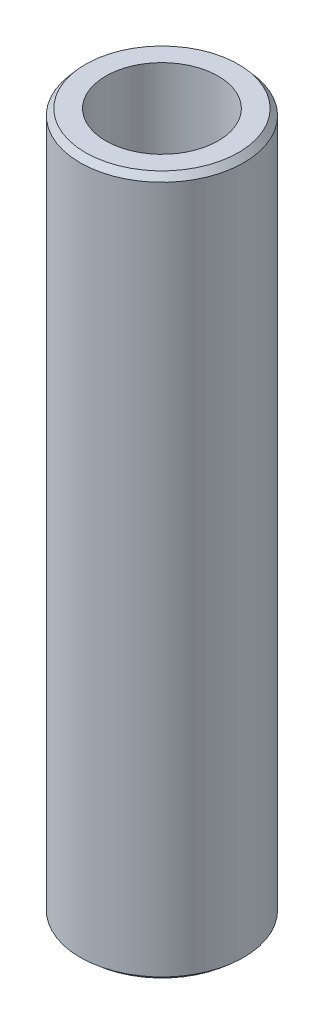
ISO-10303-21;
HEADER;
FILE_DESCRIPTION(('STEP AP214'),'2;1');
FILE_NAME('part.step','',(''),(''),'','','');
FILE_SCHEMA(('AUTOMOTIVE_DESIGN { 1 0 10303 214 1 1 1 1 }'));
ENDSEC;
DATA;
#1=APPLICATION_CONTEXT('core data for automotive mechanical design processes');
#2=APPLICATION_PROTOCOL_DEFINITION('international standard','automotive_design',2000,#1);
#3=PRODUCT_CONTEXT('',#1,'mechanical');
#4=PRODUCT('Part','Part','',(#3));
#5=PRODUCT_RELATED_PRODUCT_CATEGORY('part','',(#4));
#6=PRODUCT_DEFINITION_FORMATION('','',#4);
#7=PRODUCT_DEFINITION_CONTEXT('part definition',#1,'design');
#8=PRODUCT_DEFINITION('design','',#6,#7);
#9=PRODUCT_DEFINITION_SHAPE('','',#8);
#10=(LENGTH_UNIT() NAMED_UNIT(*) SI_UNIT(.MILLI.,.METRE.));
#11=(NAMED_UNIT(*) PLANE_ANGLE_UNIT() SI_UNIT($,.RADIAN.));
#12=(NAMED_UNIT(*) SI_UNIT($,.STERADIAN.) SOLID_ANGLE_UNIT());
#13=UNCERTAINTY_MEASURE_WITH_UNIT(LENGTH_MEASURE(1.E-05),#10,'distance_accuracy_value','');
#14=(GEOMETRIC_REPRESENTATION_CONTEXT(3) GLOBAL_UNCERTAINTY_ASSIGNED_CONTEXT((#13)) GLOBAL_UNIT_ASSIGNED_CONTEXT((#10,
#11,#12)) REPRESENTATION_CONTEXT('',''));
#15=CARTESIAN_POINT('',(0.,0.,0.));
#16=DIRECTION('',(0.,0.,1.));
#17=DIRECTION('',(1.,0.,0.));
#18=AXIS2_PLACEMENT_3D('',#15,#16,#17);
#19=CARTESIAN_POINT('',(0.,513.289780486515,0.));
#20=DIRECTION('',(0.,-1.,0.));
#21=DIRECTION('',(0.,0.,-1.));
#22=AXIS2_PLACEMENT_3D('',#19,#20,#21);
#23=CYLINDRICAL_SURFACE('',#22,60.);
#24=CARTESIAN_POINT('',(0.,508.780804512154,0.));
#25=DIRECTION('',(0.,1.,0.));
#26=DIRECTION('',(0.,0.,1.));
#27=AXIS2_PLACEMENT_3D('',#24,#25,#26);
#28=CIRCLE('',#27,60.);
#29=CARTESIAN_POINT('',(0.,508.780804512154,60.));
#30=VERTEX_POINT('',#29);
#31=EDGE_CURVE('E50',#30,#30,#28,.F.);
#32=ORIENTED_EDGE('',*,*,#31,.T.);
#33=EDGE_LOOP('',(#32));
#34=FACE_BOUND('',#33,.T.);
#35=CARTESIAN_POINT('',(0.,3.87083335466087,0.));
#36=DIRECTION('',(0.,1.,0.));
#37=DIRECTION('',(0.,0.,1.));
#38=AXIS2_PLACEMENT_3D('',#35,#36,#37);
#39=CIRCLE('',#38,60.);
#40=CARTESIAN_POINT('',(0.,3.87083335466087,60.));
#41=VERTEX_POINT('',#40);
#42=EDGE_CURVE('E51',#41,#41,#39,.T.);
#43=ORIENTED_EDGE('',*,*,#42,.T.);
#44=EDGE_LOOP('',(#43));
#45=FACE_BOUND('',#44,.T.);
#46=ADVANCED_FACE('F39',(#34,#45),#23,.T.);
#47=CARTESIAN_POINT('',(0.,513.289780486515,0.));
#48=DIRECTION('',(0.,1.,0.));
#49=DIRECTION('',(0.,0.,1.));
#50=AXIS2_PLACEMENT_3D('',#47,#48,#49);
#51=PLANE('',#50);
#52=CARTESIAN_POINT('',(0.,513.289780486515,0.));
#53=DIRECTION('',(0.,1.,0.));
#54=DIRECTION('',(0.,0.,1.));
#55=AXIS2_PLACEMENT_3D('',#52,#53,#54);
#56=CIRCLE('',#55,56.129166645339);
#57=CARTESIAN_POINT('',(0.,513.289780486515,56.129166645339));
#58=VERTEX_POINT('',#57);
#59=EDGE_CURVE('E54',#58,#58,#56,.T.);
#60=ORIENTED_EDGE('',*,*,#59,.T.);
#61=EDGE_LOOP('',(#60));
#62=FACE_BOUND('',#61,.T.);
#63=CARTESIAN_POINT('',(0.,513.289780486515,0.));
#64=DIRECTION('',(0.,1.,0.));
#65=DIRECTION('',(0.,0.,1.));
#66=AXIS2_PLACEMENT_3D('',#63,#64,#65);
#67=CIRCLE('',#66,41.2254821051725);
#68=CARTESIAN_POINT('',(0.,513.289780486515,41.2254821051725));
#69=VERTEX_POINT('',#68);
#70=EDGE_CURVE('E58',#69,#69,#67,.T.);
#71=ORIENTED_EDGE('',*,*,#70,.F.);
#72=EDGE_LOOP('',(#71));
#73=FACE_BOUND('',#72,.T.);
#74=ADVANCED_FACE('F69',(#62,#73),#51,.T.);
#75=CARTESIAN_POINT('',(0.,0.,0.));
#76=DIRECTION('',(0.,1.,0.));
#77=DIRECTION('',(0.,0.,1.));
#78=AXIS2_PLACEMENT_3D('',#75,#76,#77);
#79=PLANE('',#78);
#80=CARTESIAN_POINT('',(0.,0.,0.));
#81=DIRECTION('',(0.,1.,0.));
#82=DIRECTION('',(0.,0.,1.));
#83=AXIS2_PLACEMENT_3D('',#80,#81,#82);
#84=CIRCLE('',#83,55.4910240256393);
#85=CARTESIAN_POINT('',(0.,0.,55.4910240256393));
#86=VERTEX_POINT('',#85);
#87=EDGE_CURVE('E10',#86,#86,#84,.F.);
#88=ORIENTED_EDGE('',*,*,#87,.T.);
#89=EDGE_LOOP('',(#88));
#90=FACE_BOUND('',#89,.T.);
#91=CARTESIAN_POINT('',(0.,0.,0.));
#92=DIRECTION('',(0.,1.,0.));
#93=DIRECTION('',(0.,0.,1.));
#94=AXIS2_PLACEMENT_3D('',#91,#92,#93);
#95=CIRCLE('',#94,41.2254821051725);
#96=CARTESIAN_POINT('',(0.,0.,41.2254821051725));
#97=VERTEX_POINT('',#96);
#98=EDGE_CURVE('E63',#97,#97,#95,.T.);
#99=ORIENTED_EDGE('',*,*,#98,.T.);
#100=EDGE_LOOP('',(#99));
#101=FACE_BOUND('',#100,.T.);
#102=ADVANCED_FACE('F75',(#90,#101),#79,.F.);
#103=CARTESIAN_POINT('',(0.,513.289780486515,0.));
#104=DIRECTION('',(0.,-1.,0.));
#105=DIRECTION('',(0.,0.,-1.));
#106=AXIS2_PLACEMENT_3D('',#103,#104,#105);
#107=CYLINDRICAL_SURFACE('',#106,41.2254821051725);
#108=ORIENTED_EDGE('',*,*,#70,.T.);
#109=EDGE_LOOP('',(#108));
#110=FACE_BOUND('',#109,.T.);
#111=ORIENTED_EDGE('',*,*,#98,.F.);
#112=EDGE_LOOP('',(#111));
#113=FACE_BOUND('',#112,.T.);
#114=ADVANCED_FACE('F70',(#110,#113),#107,.F.);
#115=CARTESIAN_POINT('',(0.,513.289780486515,0.));
#116=DIRECTION('',(0.,-1.,0.));
#117=DIRECTION('',(0.,0.,-1.));
#118=AXIS2_PLACEMENT_3D('',#115,#116,#117);
#119=CONICAL_SURFACE('',#118,56.129166645339,0.709392457369066);
#120=ORIENTED_EDGE('',*,*,#31,.F.);
#121=EDGE_LOOP('',(#120));
#122=FACE_BOUND('',#121,.T.);
#123=ORIENTED_EDGE('',*,*,#59,.F.);
#124=EDGE_LOOP('',(#123));
#125=FACE_BOUND('',#124,.T.);
#126=ADVANCED_FACE('F81',(#122,#125),#119,.T.);
#127=CARTESIAN_POINT('',(0.,3.87083335466087,0.));
#128=DIRECTION('',(0.,1.,0.));
#129=DIRECTION('',(0.,0.,1.));
#130=AXIS2_PLACEMENT_3D('',#127,#128,#129);
#131=CONICAL_SURFACE('',#130,60.,0.86140386942582);
#132=ORIENTED_EDGE('',*,*,#87,.F.);
#133=EDGE_LOOP('',(#132));
#134=FACE_BOUND('',#133,.T.);
#135=ORIENTED_EDGE('',*,*,#42,.F.);
#136=EDGE_LOOP('',(#135));
#137=FACE_BOUND('',#136,.T.);
#138=ADVANCED_FACE('F45',(#134,#137),#131,.T.);
#139=CLOSED_SHELL('',(#46,#74,#102,#114,#126,#138));
#140=MANIFOLD_SOLID_BREP('B2',#139);
#141=ADVANCED_BREP_SHAPE_REPRESENTATION('',(#18,#140),#14);
#142=SHAPE_DEFINITION_REPRESENTATION(#9,#141);
ENDSEC;
END-ISO-10303-21;
